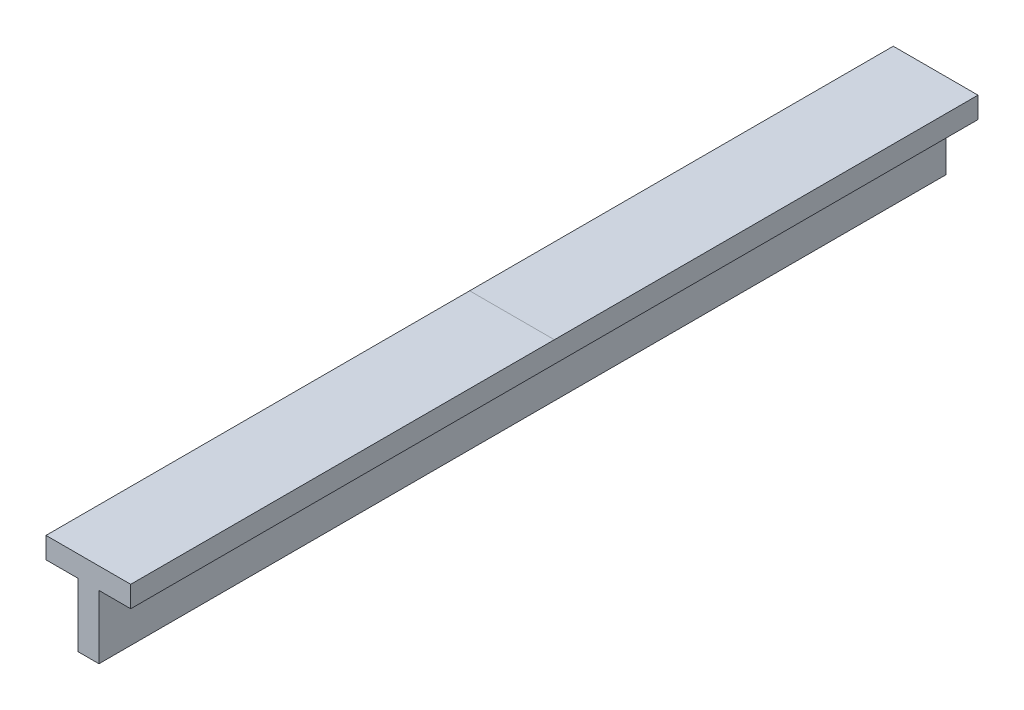
ISO-10303-21;
HEADER;
FILE_DESCRIPTION(('STEP AP214'),'2;1');
FILE_NAME('part.step','',(''),(''),'','','');
FILE_SCHEMA(('AUTOMOTIVE_DESIGN { 1 0 10303 214 1 1 1 1 }'));
ENDSEC;
DATA;
#1=APPLICATION_CONTEXT('core data for automotive mechanical design processes');
#2=APPLICATION_PROTOCOL_DEFINITION('international standard','automotive_design',2000,#1);
#3=PRODUCT_CONTEXT('',#1,'mechanical');
#4=PRODUCT('Part','Part','',(#3));
#5=PRODUCT_RELATED_PRODUCT_CATEGORY('part','',(#4));
#6=PRODUCT_DEFINITION_FORMATION('','',#4);
#7=PRODUCT_DEFINITION_CONTEXT('part definition',#1,'design');
#8=PRODUCT_DEFINITION('design','',#6,#7);
#9=PRODUCT_DEFINITION_SHAPE('','',#8);
#10=(LENGTH_UNIT() NAMED_UNIT(*) SI_UNIT(.MILLI.,.METRE.));
#11=(NAMED_UNIT(*) PLANE_ANGLE_UNIT() SI_UNIT($,.RADIAN.));
#12=(NAMED_UNIT(*) SI_UNIT($,.STERADIAN.) SOLID_ANGLE_UNIT());
#13=UNCERTAINTY_MEASURE_WITH_UNIT(LENGTH_MEASURE(1.E-05),#10,'distance_accuracy_value','');
#14=(GEOMETRIC_REPRESENTATION_CONTEXT(3) GLOBAL_UNCERTAINTY_ASSIGNED_CONTEXT((#13)) GLOBAL_UNIT_ASSIGNED_CONTEXT((#10,
#11,#12)) REPRESENTATION_CONTEXT('',''));
#15=CARTESIAN_POINT('',(0.,0.,0.));
#16=DIRECTION('',(0.,0.,1.));
#17=DIRECTION('',(1.,0.,0.));
#18=AXIS2_PLACEMENT_3D('',#15,#16,#17);
#19=CARTESIAN_POINT('',(0.,0.,2000.));
#20=DIRECTION('',(0.,1.,0.));
#21=DIRECTION('',(0.,0.,1.));
#22=AXIS2_PLACEMENT_3D('',#19,#20,#21);
#23=PLANE('',#22);
#24=DIRECTION('',(-1.,0.,0.));
#25=VECTOR('',#24,1.);
#26=CARTESIAN_POINT('',(0.,0.,1000.));
#27=LINE('',#26,#25);
#28=CARTESIAN_POINT('',(50.,0.,1000.));
#29=VERTEX_POINT('',#28);
#30=CARTESIAN_POINT('',(0.,0.,1000.));
#31=VERTEX_POINT('',#30);
#32=EDGE_CURVE('E12',#29,#31,#27,.T.);
#33=ORIENTED_EDGE('',*,*,#32,.F.);
#34=DIRECTION('',(0.,0.,-1.));
#35=VECTOR('',#34,1.);
#36=CARTESIAN_POINT('',(50.,0.,2000.));
#37=LINE('',#36,#35);
#38=CARTESIAN_POINT('',(50.,0.,2000.));
#39=VERTEX_POINT('',#38);
#40=EDGE_CURVE('E125',#39,#29,#37,.T.);
#41=ORIENTED_EDGE('',*,*,#40,.F.);
#42=DIRECTION('',(1.,0.,0.));
#43=VECTOR('',#42,1.);
#44=CARTESIAN_POINT('',(0.,0.,2000.));
#45=LINE('',#44,#43);
#46=CARTESIAN_POINT('',(0.,0.,2000.));
#47=VERTEX_POINT('',#46);
#48=EDGE_CURVE('E120',#47,#39,#45,.T.);
#49=ORIENTED_EDGE('',*,*,#48,.F.);
#50=DIRECTION('',(0.,0.,-1.));
#51=VECTOR('',#50,1.);
#52=CARTESIAN_POINT('',(0.,0.,2000.));
#53=LINE('',#52,#51);
#54=EDGE_CURVE('E123',#47,#31,#53,.T.);
#55=ORIENTED_EDGE('',*,*,#54,.T.);
#56=EDGE_LOOP('',(#33,#41,#49,#55));
#57=FACE_BOUND('',#56,.T.);
#58=ADVANCED_FACE('F48',(#57),#23,.F.);
#59=CARTESIAN_POINT('',(125.,200.,2000.));
#60=DIRECTION('',(0.,-1.,0.));
#61=DIRECTION('',(0.,0.,-1.));
#62=AXIS2_PLACEMENT_3D('',#59,#60,#61);
#63=PLANE('',#62);
#64=DIRECTION('',(1.,0.,0.));
#65=VECTOR('',#64,1.);
#66=CARTESIAN_POINT('',(125.,200.,1000.));
#67=LINE('',#66,#65);
#68=CARTESIAN_POINT('',(-75.,200.,1000.));
#69=VERTEX_POINT('',#68);
#70=CARTESIAN_POINT('',(125.,200.,1000.));
#71=VERTEX_POINT('',#70);
#72=EDGE_CURVE('E52',#69,#71,#67,.T.);
#73=ORIENTED_EDGE('',*,*,#72,.F.);
#74=DIRECTION('',(0.,0.,-1.));
#75=VECTOR('',#74,1.);
#76=CARTESIAN_POINT('',(-75.,200.,2000.));
#77=LINE('',#76,#75);
#78=CARTESIAN_POINT('',(-75.,200.,2000.));
#79=VERTEX_POINT('',#78);
#80=EDGE_CURVE('E204',#79,#69,#77,.T.);
#81=ORIENTED_EDGE('',*,*,#80,.F.);
#82=DIRECTION('',(-1.,0.,0.));
#83=VECTOR('',#82,1.);
#84=CARTESIAN_POINT('',(125.,200.,2000.));
#85=LINE('',#84,#83);
#86=CARTESIAN_POINT('',(125.,200.,2000.));
#87=VERTEX_POINT('',#86);
#88=EDGE_CURVE('E248',#87,#79,#85,.T.);
#89=ORIENTED_EDGE('',*,*,#88,.F.);
#90=DIRECTION('',(0.,0.,-1.));
#91=VECTOR('',#90,1.);
#92=CARTESIAN_POINT('',(125.,200.,2000.));
#93=LINE('',#92,#91);
#94=EDGE_CURVE('E211',#87,#71,#93,.T.);
#95=ORIENTED_EDGE('',*,*,#94,.T.);
#96=EDGE_LOOP('',(#73,#81,#89,#95));
#97=FACE_BOUND('',#96,.T.);
#98=ADVANCED_FACE('F283',(#97),#63,.F.);
#99=CARTESIAN_POINT('',(0.,150.,2000.));
#100=DIRECTION('',(1.,0.,0.));
#101=DIRECTION('',(0.,1.,0.));
#102=AXIS2_PLACEMENT_3D('',#99,#100,#101);
#103=PLANE('',#102);
#104=DIRECTION('',(0.,-1.,0.));
#105=VECTOR('',#104,1.);
#106=CARTESIAN_POINT('',(0.,150.,0.));
#107=LINE('',#106,#105);
#108=CARTESIAN_POINT('',(0.,150.,0.));
#109=VERTEX_POINT('',#108);
#110=CARTESIAN_POINT('',(0.,0.,0.));
#111=VERTEX_POINT('',#110);
#112=EDGE_CURVE('E188',#109,#111,#107,.T.);
#113=ORIENTED_EDGE('',*,*,#112,.T.);
#114=EDGE_CURVE('E143',#31,#111,#53,.T.);
#115=ORIENTED_EDGE('',*,*,#114,.F.);
#116=ORIENTED_EDGE('',*,*,#54,.F.);
#117=DIRECTION('',(0.,-1.,0.));
#118=VECTOR('',#117,1.);
#119=CARTESIAN_POINT('',(0.,150.,2000.));
#120=LINE('',#119,#118);
#121=CARTESIAN_POINT('',(0.,150.,2000.));
#122=VERTEX_POINT('',#121);
#123=EDGE_CURVE('E130',#122,#47,#120,.T.);
#124=ORIENTED_EDGE('',*,*,#123,.F.);
#125=DIRECTION('',(0.,0.,-1.));
#126=VECTOR('',#125,1.);
#127=CARTESIAN_POINT('',(0.,150.,2000.));
#128=LINE('',#127,#126);
#129=EDGE_CURVE('E185',#122,#109,#128,.T.);
#130=ORIENTED_EDGE('',*,*,#129,.T.);
#131=EDGE_LOOP('',(#113,#115,#116,#124,#130));
#132=FACE_BOUND('',#131,.T.);
#133=ADVANCED_FACE('F50',(#132),#103,.F.);
#134=CARTESIAN_POINT('',(50.,0.,0.));
#135=VERTEX_POINT('',#134);
#136=EDGE_CURVE('E152',#29,#135,#37,.T.);
#137=ORIENTED_EDGE('',*,*,#136,.F.);
#138=ORIENTED_EDGE('',*,*,#32,.T.);
#139=ORIENTED_EDGE('',*,*,#114,.T.);
#140=DIRECTION('',(1.,0.,0.));
#141=VECTOR('',#140,1.);
#142=CARTESIAN_POINT('',(0.,0.,0.));
#143=LINE('',#142,#141);
#144=EDGE_CURVE('E193',#111,#135,#143,.T.);
#145=ORIENTED_EDGE('',*,*,#144,.T.);
#146=EDGE_LOOP('',(#137,#138,#139,#145));
#147=FACE_BOUND('',#146,.T.);
#148=ADVANCED_FACE('F234',(#147),#23,.F.);
#149=CARTESIAN_POINT('',(50.,0.,2000.));
#150=DIRECTION('',(-1.,0.,0.));
#151=DIRECTION('',(0.,0.,1.));
#152=AXIS2_PLACEMENT_3D('',#149,#150,#151);
#153=PLANE('',#152);
#154=DIRECTION('',(0.,1.,0.));
#155=VECTOR('',#154,1.);
#156=CARTESIAN_POINT('',(50.,0.,0.));
#157=LINE('',#156,#155);
#158=CARTESIAN_POINT('',(50.,150.,0.));
#159=VERTEX_POINT('',#158);
#160=EDGE_CURVE('E197',#135,#159,#157,.T.);
#161=ORIENTED_EDGE('',*,*,#160,.T.);
#162=DIRECTION('',(0.,0.,-1.));
#163=VECTOR('',#162,1.);
#164=CARTESIAN_POINT('',(50.,150.,2000.));
#165=LINE('',#164,#163);
#166=CARTESIAN_POINT('',(50.,150.,2000.));
#167=VERTEX_POINT('',#166);
#168=EDGE_CURVE('E153',#167,#159,#165,.T.);
#169=ORIENTED_EDGE('',*,*,#168,.F.);
#170=DIRECTION('',(0.,1.,0.));
#171=VECTOR('',#170,1.);
#172=CARTESIAN_POINT('',(50.,0.,2000.));
#173=LINE('',#172,#171);
#174=EDGE_CURVE('E129',#39,#167,#173,.T.);
#175=ORIENTED_EDGE('',*,*,#174,.F.);
#176=ORIENTED_EDGE('',*,*,#40,.T.);
#177=ORIENTED_EDGE('',*,*,#136,.T.);
#178=EDGE_LOOP('',(#161,#169,#175,#176,#177));
#179=FACE_BOUND('',#178,.T.);
#180=ADVANCED_FACE('F231',(#179),#153,.F.);
#181=CARTESIAN_POINT('',(50.,150.,2000.));
#182=DIRECTION('',(0.,1.,0.));
#183=DIRECTION('',(-1.,0.,0.));
#184=AXIS2_PLACEMENT_3D('',#181,#182,#183);
#185=PLANE('',#184);
#186=DIRECTION('',(1.,0.,0.));
#187=VECTOR('',#186,1.);
#188=CARTESIAN_POINT('',(50.,150.,0.));
#189=LINE('',#188,#187);
#190=CARTESIAN_POINT('',(125.,150.,0.));
#191=VERTEX_POINT('',#190);
#192=EDGE_CURVE('E172',#159,#191,#189,.T.);
#193=ORIENTED_EDGE('',*,*,#192,.T.);
#194=DIRECTION('',(0.,0.,-1.));
#195=VECTOR('',#194,1.);
#196=CARTESIAN_POINT('',(125.,150.,2000.));
#197=LINE('',#196,#195);
#198=CARTESIAN_POINT('',(125.,150.,2000.));
#199=VERTEX_POINT('',#198);
#200=EDGE_CURVE('E215',#199,#191,#197,.T.);
#201=ORIENTED_EDGE('',*,*,#200,.F.);
#202=DIRECTION('',(1.,0.,0.));
#203=VECTOR('',#202,1.);
#204=CARTESIAN_POINT('',(50.,150.,2000.));
#205=LINE('',#204,#203);
#206=EDGE_CURVE('E242',#167,#199,#205,.T.);
#207=ORIENTED_EDGE('',*,*,#206,.F.);
#208=ORIENTED_EDGE('',*,*,#168,.T.);
#209=EDGE_LOOP('',(#193,#201,#207,#208));
#210=FACE_BOUND('',#209,.T.);
#211=ADVANCED_FACE('F295',(#210),#185,.F.);
#212=CARTESIAN_POINT('',(125.,150.,2000.));
#213=DIRECTION('',(-1.,0.,0.));
#214=DIRECTION('',(0.,0.,1.));
#215=AXIS2_PLACEMENT_3D('',#212,#213,#214);
#216=PLANE('',#215);
#217=DIRECTION('',(0.,1.,0.));
#218=VECTOR('',#217,1.);
#219=CARTESIAN_POINT('',(125.,150.,0.));
#220=LINE('',#219,#218);
#221=CARTESIAN_POINT('',(125.,200.,0.));
#222=VERTEX_POINT('',#221);
#223=EDGE_CURVE('E167',#191,#222,#220,.T.);
#224=ORIENTED_EDGE('',*,*,#223,.T.);
#225=EDGE_CURVE('E208',#71,#222,#93,.T.);
#226=ORIENTED_EDGE('',*,*,#225,.F.);
#227=ORIENTED_EDGE('',*,*,#94,.F.);
#228=DIRECTION('',(0.,1.,0.));
#229=VECTOR('',#228,1.);
#230=CARTESIAN_POINT('',(125.,150.,2000.));
#231=LINE('',#230,#229);
#232=EDGE_CURVE('E245',#199,#87,#231,.T.);
#233=ORIENTED_EDGE('',*,*,#232,.F.);
#234=ORIENTED_EDGE('',*,*,#200,.T.);
#235=EDGE_LOOP('',(#224,#226,#227,#233,#234));
#236=FACE_BOUND('',#235,.T.);
#237=ADVANCED_FACE('F265',(#236),#216,.F.);
#238=CARTESIAN_POINT('',(-75.,200.,0.));
#239=VERTEX_POINT('',#238);
#240=EDGE_CURVE('E209',#69,#239,#77,.T.);
#241=ORIENTED_EDGE('',*,*,#240,.F.);
#242=ORIENTED_EDGE('',*,*,#72,.T.);
#243=ORIENTED_EDGE('',*,*,#225,.T.);
#244=DIRECTION('',(-1.,0.,0.));
#245=VECTOR('',#244,1.);
#246=CARTESIAN_POINT('',(125.,200.,0.));
#247=LINE('',#246,#245);
#248=EDGE_CURVE('E171',#222,#239,#247,.T.);
#249=ORIENTED_EDGE('',*,*,#248,.T.);
#250=EDGE_LOOP('',(#241,#242,#243,#249));
#251=FACE_BOUND('',#250,.T.);
#252=ADVANCED_FACE('F262',(#251),#63,.F.);
#253=CARTESIAN_POINT('',(-75.,200.,2000.));
#254=DIRECTION('',(1.,0.,0.));
#255=DIRECTION('',(0.,1.,0.));
#256=AXIS2_PLACEMENT_3D('',#253,#254,#255);
#257=PLANE('',#256);
#258=DIRECTION('',(0.,-1.,0.));
#259=VECTOR('',#258,1.);
#260=CARTESIAN_POINT('',(-75.,200.,0.));
#261=LINE('',#260,#259);
#262=CARTESIAN_POINT('',(-75.,150.,0.));
#263=VERTEX_POINT('',#262);
#264=EDGE_CURVE('E179',#239,#263,#261,.T.);
#265=ORIENTED_EDGE('',*,*,#264,.T.);
#266=DIRECTION('',(0.,0.,-1.));
#267=VECTOR('',#266,1.);
#268=CARTESIAN_POINT('',(-75.,150.,2000.));
#269=LINE('',#268,#267);
#270=CARTESIAN_POINT('',(-75.,150.,2000.));
#271=VERTEX_POINT('',#270);
#272=EDGE_CURVE('E210',#271,#263,#269,.T.);
#273=ORIENTED_EDGE('',*,*,#272,.F.);
#274=DIRECTION('',(0.,-1.,0.));
#275=VECTOR('',#274,1.);
#276=CARTESIAN_POINT('',(-75.,200.,2000.));
#277=LINE('',#276,#275);
#278=EDGE_CURVE('E251',#79,#271,#277,.T.);
#279=ORIENTED_EDGE('',*,*,#278,.F.);
#280=ORIENTED_EDGE('',*,*,#80,.T.);
#281=ORIENTED_EDGE('',*,*,#240,.T.);
#282=EDGE_LOOP('',(#265,#273,#279,#280,#281));
#283=FACE_BOUND('',#282,.T.);
#284=ADVANCED_FACE('F269',(#283),#257,.F.);
#285=CARTESIAN_POINT('',(-75.,150.,2000.));
#286=DIRECTION('',(0.,1.,0.));
#287=DIRECTION('',(-1.,0.,0.));
#288=AXIS2_PLACEMENT_3D('',#285,#286,#287);
#289=PLANE('',#288);
#290=DIRECTION('',(1.,0.,0.));
#291=VECTOR('',#290,1.);
#292=CARTESIAN_POINT('',(-75.,150.,0.));
#293=LINE('',#292,#291);
#294=EDGE_CURVE('E140',#263,#109,#293,.T.);
#295=ORIENTED_EDGE('',*,*,#294,.T.);
#296=ORIENTED_EDGE('',*,*,#129,.F.);
#297=DIRECTION('',(1.,0.,0.));
#298=VECTOR('',#297,1.);
#299=CARTESIAN_POINT('',(-75.,150.,2000.));
#300=LINE('',#299,#298);
#301=EDGE_CURVE('E135',#271,#122,#300,.T.);
#302=ORIENTED_EDGE('',*,*,#301,.F.);
#303=ORIENTED_EDGE('',*,*,#272,.T.);
#304=EDGE_LOOP('',(#295,#296,#302,#303));
#305=FACE_BOUND('',#304,.T.);
#306=ADVANCED_FACE('F272',(#305),#289,.F.);
#307=CARTESIAN_POINT('',(0.,0.,2000.));
#308=DIRECTION('',(0.,0.,1.));
#309=DIRECTION('',(1.,0.,0.));
#310=AXIS2_PLACEMENT_3D('',#307,#308,#309);
#311=PLANE('',#310);
#312=ORIENTED_EDGE('',*,*,#123,.T.);
#313=ORIENTED_EDGE('',*,*,#48,.T.);
#314=ORIENTED_EDGE('',*,*,#174,.T.);
#315=ORIENTED_EDGE('',*,*,#206,.T.);
#316=ORIENTED_EDGE('',*,*,#232,.T.);
#317=ORIENTED_EDGE('',*,*,#88,.T.);
#318=ORIENTED_EDGE('',*,*,#278,.T.);
#319=ORIENTED_EDGE('',*,*,#301,.T.);
#320=EDGE_LOOP('',(#312,#313,#314,#315,#316,#317,#318,#319));
#321=FACE_BOUND('',#320,.T.);
#322=ADVANCED_FACE('F133',(#321),#311,.T.);
#323=CARTESIAN_POINT('',(0.,0.,0.));
#324=DIRECTION('',(0.,0.,1.));
#325=DIRECTION('',(1.,0.,0.));
#326=AXIS2_PLACEMENT_3D('',#323,#324,#325);
#327=PLANE('',#326);
#328=ORIENTED_EDGE('',*,*,#112,.F.);
#329=ORIENTED_EDGE('',*,*,#294,.F.);
#330=ORIENTED_EDGE('',*,*,#264,.F.);
#331=ORIENTED_EDGE('',*,*,#248,.F.);
#332=ORIENTED_EDGE('',*,*,#223,.F.);
#333=ORIENTED_EDGE('',*,*,#192,.F.);
#334=ORIENTED_EDGE('',*,*,#160,.F.);
#335=ORIENTED_EDGE('',*,*,#144,.F.);
#336=EDGE_LOOP('',(#328,#329,#330,#331,#332,#333,#334,#335));
#337=FACE_BOUND('',#336,.T.);
#338=ADVANCED_FACE('F237',(#337),#327,.F.);
#339=CLOSED_SHELL('',(#58,#98,#133,#148,#180,#211,#237,#252,#284,#306,#322,#338));
#340=MANIFOLD_SOLID_BREP('B2',#339);
#341=ADVANCED_BREP_SHAPE_REPRESENTATION('',(#18,#340),#14);
#342=SHAPE_DEFINITION_REPRESENTATION(#9,#341);
ENDSEC;
END-ISO-10303-21;
